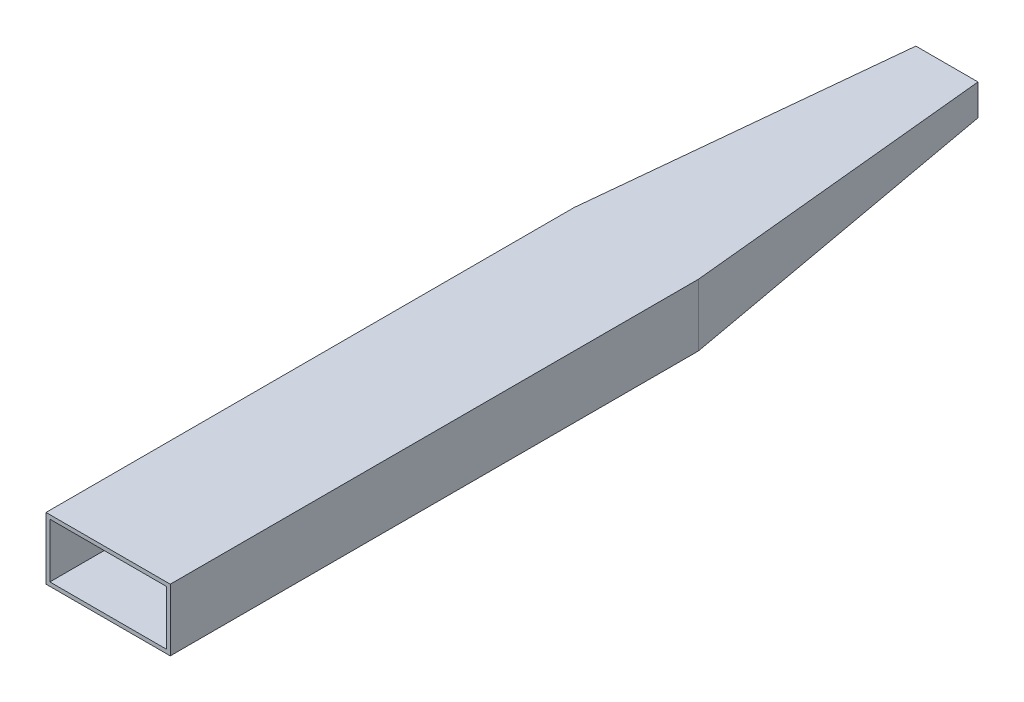
ISO-10303-21;
HEADER;
FILE_DESCRIPTION(('STEP AP214'),'2;1');
FILE_NAME('part.step','',(''),(''),'','','');
FILE_SCHEMA(('AUTOMOTIVE_DESIGN { 1 0 10303 214 1 1 1 1 }'));
ENDSEC;
DATA;
#1=APPLICATION_CONTEXT('core data for automotive mechanical design processes');
#2=APPLICATION_PROTOCOL_DEFINITION('international standard','automotive_design',2000,#1);
#3=PRODUCT_CONTEXT('',#1,'mechanical');
#4=PRODUCT('Part','Part','',(#3));
#5=PRODUCT_RELATED_PRODUCT_CATEGORY('part','',(#4));
#6=PRODUCT_DEFINITION_FORMATION('','',#4);
#7=PRODUCT_DEFINITION_CONTEXT('part definition',#1,'design');
#8=PRODUCT_DEFINITION('design','',#6,#7);
#9=PRODUCT_DEFINITION_SHAPE('','',#8);
#10=(LENGTH_UNIT() NAMED_UNIT(*) SI_UNIT(.MILLI.,.METRE.));
#11=(NAMED_UNIT(*) PLANE_ANGLE_UNIT() SI_UNIT($,.RADIAN.));
#12=(NAMED_UNIT(*) SI_UNIT($,.STERADIAN.) SOLID_ANGLE_UNIT());
#13=UNCERTAINTY_MEASURE_WITH_UNIT(LENGTH_MEASURE(1.E-05),#10,'distance_accuracy_value','');
#14=(GEOMETRIC_REPRESENTATION_CONTEXT(3) GLOBAL_UNCERTAINTY_ASSIGNED_CONTEXT((#13)) GLOBAL_UNIT_ASSIGNED_CONTEXT((#10,
#11,#12)) REPRESENTATION_CONTEXT('',''));
#15=CARTESIAN_POINT('',(0.,0.,0.));
#16=DIRECTION('',(0.,0.,1.));
#17=DIRECTION('',(1.,0.,0.));
#18=AXIS2_PLACEMENT_3D('',#15,#16,#17);
#19=CARTESIAN_POINT('',(0.,0.,0.));
#20=DIRECTION('',(0.,0.,-1.));
#21=DIRECTION('',(-1.,0.,0.));
#22=AXIS2_PLACEMENT_3D('',#19,#20,#21);
#23=PLANE('',#22);
#24=DIRECTION('',(0.,1.,0.));
#25=VECTOR('',#24,1.);
#26=CARTESIAN_POINT('',(50.8,-25.4,0.));
#27=LINE('',#26,#25);
#28=CARTESIAN_POINT('',(50.8,-25.4,0.));
#29=VERTEX_POINT('',#28);
#30=CARTESIAN_POINT('',(50.8,25.4,0.));
#31=VERTEX_POINT('',#30);
#32=EDGE_CURVE('E296',#29,#31,#27,.T.);
#33=ORIENTED_EDGE('',*,*,#32,.T.);
#34=DIRECTION('',(-1.,0.,0.));
#35=VECTOR('',#34,1.);
#36=CARTESIAN_POINT('',(-50.8,25.4,0.));
#37=LINE('',#36,#35);
#38=CARTESIAN_POINT('',(-50.8,25.4,0.));
#39=VERTEX_POINT('',#38);
#40=EDGE_CURVE('E333',#31,#39,#37,.T.);
#41=ORIENTED_EDGE('',*,*,#40,.T.);
#42=DIRECTION('',(0.,-1.,0.));
#43=VECTOR('',#42,1.);
#44=CARTESIAN_POINT('',(-50.8,-25.4,0.));
#45=LINE('',#44,#43);
#46=CARTESIAN_POINT('',(-50.8,-25.4,0.));
#47=VERTEX_POINT('',#46);
#48=EDGE_CURVE('E337',#39,#47,#45,.T.);
#49=ORIENTED_EDGE('',*,*,#48,.T.);
#50=DIRECTION('',(1.,0.,0.));
#51=VECTOR('',#50,1.);
#52=CARTESIAN_POINT('',(-50.8,-25.4,0.));
#53=LINE('',#52,#51);
#54=EDGE_CURVE('E341',#47,#29,#53,.T.);
#55=ORIENTED_EDGE('',*,*,#54,.T.);
#56=EDGE_LOOP('',(#33,#41,#49,#55));
#57=FACE_BOUND('',#56,.T.);
#58=DIRECTION('',(0.,1.,0.));
#59=VECTOR('',#58,1.);
#60=CARTESIAN_POINT('',(47.625,-25.4,0.));
#61=LINE('',#60,#59);
#62=CARTESIAN_POINT('',(47.625,-22.225,0.));
#63=VERTEX_POINT('',#62);
#64=CARTESIAN_POINT('',(47.625,22.225,0.));
#65=VERTEX_POINT('',#64);
#66=EDGE_CURVE('E200',#63,#65,#61,.T.);
#67=ORIENTED_EDGE('',*,*,#66,.F.);
#68=DIRECTION('',(1.,0.,0.));
#69=VECTOR('',#68,1.);
#70=CARTESIAN_POINT('',(-50.8,-22.225,0.));
#71=LINE('',#70,#69);
#72=CARTESIAN_POINT('',(-47.625,-22.225,0.));
#73=VERTEX_POINT('',#72);
#74=EDGE_CURVE('E156',#73,#63,#71,.T.);
#75=ORIENTED_EDGE('',*,*,#74,.F.);
#76=DIRECTION('',(0.,-1.,0.));
#77=VECTOR('',#76,1.);
#78=CARTESIAN_POINT('',(-47.625,-25.4,0.));
#79=LINE('',#78,#77);
#80=CARTESIAN_POINT('',(-47.625,22.225,0.));
#81=VERTEX_POINT('',#80);
#82=EDGE_CURVE('E69',#81,#73,#79,.T.);
#83=ORIENTED_EDGE('',*,*,#82,.F.);
#84=DIRECTION('',(-1.,0.,0.));
#85=VECTOR('',#84,1.);
#86=CARTESIAN_POINT('',(-50.8,22.225,0.));
#87=LINE('',#86,#85);
#88=EDGE_CURVE('E203',#65,#81,#87,.T.);
#89=ORIENTED_EDGE('',*,*,#88,.F.);
#90=EDGE_LOOP('',(#67,#75,#83,#89));
#91=FACE_BOUND('',#90,.T.);
#92=ADVANCED_FACE('F51',(#57,#91),#23,.F.);
#93=CARTESIAN_POINT('',(0.,0.,-685.8));
#94=DIRECTION('',(0.,0.,1.));
#95=DIRECTION('',(1.,0.,0.));
#96=AXIS2_PLACEMENT_3D('',#93,#94,#95);
#97=PLANE('',#96);
#98=DIRECTION('',(0.,-1.,0.));
#99=VECTOR('',#98,1.);
#100=CARTESIAN_POINT('',(25.4,0.,-685.8));
#101=LINE('',#100,#99);
#102=CARTESIAN_POINT('',(25.4,25.4,-685.8));
#103=VERTEX_POINT('',#102);
#104=CARTESIAN_POINT('',(25.4,0.,-685.8));
#105=VERTEX_POINT('',#104);
#106=EDGE_CURVE('E242',#103,#105,#101,.T.);
#107=ORIENTED_EDGE('',*,*,#106,.T.);
#108=DIRECTION('',(-1.,0.,0.));
#109=VECTOR('',#108,1.);
#110=CARTESIAN_POINT('',(25.4,0.,-685.8));
#111=LINE('',#110,#109);
#112=CARTESIAN_POINT('',(-25.4,0.,-685.8));
#113=VERTEX_POINT('',#112);
#114=EDGE_CURVE('E249',#105,#113,#111,.T.);
#115=ORIENTED_EDGE('',*,*,#114,.T.);
#116=DIRECTION('',(0.,1.,0.));
#117=VECTOR('',#116,1.);
#118=CARTESIAN_POINT('',(-25.4,0.,-685.8));
#119=LINE('',#118,#117);
#120=CARTESIAN_POINT('',(-25.4,25.4,-685.8));
#121=VERTEX_POINT('',#120);
#122=EDGE_CURVE('E297',#113,#121,#119,.T.);
#123=ORIENTED_EDGE('',*,*,#122,.T.);
#124=DIRECTION('',(1.,0.,0.));
#125=VECTOR('',#124,1.);
#126=CARTESIAN_POINT('',(25.4,25.4,-685.8));
#127=LINE('',#126,#125);
#128=EDGE_CURVE('E315',#121,#103,#127,.T.);
#129=ORIENTED_EDGE('',*,*,#128,.T.);
#130=EDGE_LOOP('',(#107,#115,#123,#129));
#131=FACE_BOUND('',#130,.T.);
#132=DIRECTION('',(0.,-1.,0.));
#133=VECTOR('',#132,1.);
#134=CARTESIAN_POINT('',(22.2091644902941,0.,-685.8));
#135=LINE('',#134,#133);
#136=CARTESIAN_POINT('',(22.2091644902941,22.225,-685.8));
#137=VERTEX_POINT('',#136);
#138=CARTESIAN_POINT('',(22.2091644902941,3.19083550970587,-685.8));
#139=VERTEX_POINT('',#138);
#140=EDGE_CURVE('E162',#137,#139,#135,.T.);
#141=ORIENTED_EDGE('',*,*,#140,.F.);
#142=DIRECTION('',(1.,0.,0.));
#143=VECTOR('',#142,1.);
#144=CARTESIAN_POINT('',(-50.8,22.225,-685.8));
#145=LINE('',#144,#143);
#146=CARTESIAN_POINT('',(-22.2091644902941,22.225,-685.8));
#147=VERTEX_POINT('',#146);
#148=EDGE_CURVE('E212',#147,#137,#145,.T.);
#149=ORIENTED_EDGE('',*,*,#148,.F.);
#150=DIRECTION('',(0.,1.,0.));
#151=VECTOR('',#150,1.);
#152=CARTESIAN_POINT('',(-22.2091644902941,0.,-685.8));
#153=LINE('',#152,#151);
#154=CARTESIAN_POINT('',(-22.2091644902941,3.19083550970586,-685.8));
#155=VERTEX_POINT('',#154);
#156=EDGE_CURVE('E215',#155,#147,#153,.T.);
#157=ORIENTED_EDGE('',*,*,#156,.F.);
#158=DIRECTION('',(-1.,0.,0.));
#159=VECTOR('',#158,1.);
#160=CARTESIAN_POINT('',(0.,3.19083550970587,-685.8));
#161=LINE('',#160,#159);
#162=EDGE_CURVE('E204',#139,#155,#161,.T.);
#163=ORIENTED_EDGE('',*,*,#162,.F.);
#164=EDGE_LOOP('',(#141,#149,#157,#163));
#165=FACE_BOUND('',#164,.T.);
#166=ADVANCED_FACE('F275',(#131,#165),#97,.F.);
#167=CARTESIAN_POINT('',(50.8,-25.4,-431.8));
#168=DIRECTION('',(1.,0.,0.));
#169=DIRECTION('',(0.,0.,-1.));
#170=AXIS2_PLACEMENT_3D('',#167,#168,#169);
#171=PLANE('',#170);
#172=ORIENTED_EDGE('',*,*,#32,.F.);
#173=DIRECTION('',(0.,0.,1.));
#174=VECTOR('',#173,1.);
#175=CARTESIAN_POINT('',(50.8,-25.4,-431.8));
#176=LINE('',#175,#174);
#177=CARTESIAN_POINT('',(50.8,-25.4,-431.8));
#178=VERTEX_POINT('',#177);
#179=EDGE_CURVE('E12',#178,#29,#176,.T.);
#180=ORIENTED_EDGE('',*,*,#179,.F.);
#181=DIRECTION('',(0.,1.,0.));
#182=VECTOR('',#181,1.);
#183=CARTESIAN_POINT('',(50.8,-25.4,-431.8));
#184=LINE('',#183,#182);
#185=CARTESIAN_POINT('',(50.8,25.4,-431.8));
#186=VERTEX_POINT('',#185);
#187=EDGE_CURVE('E345',#178,#186,#184,.T.);
#188=ORIENTED_EDGE('',*,*,#187,.T.);
#189=DIRECTION('',(0.,0.,1.));
#190=VECTOR('',#189,1.);
#191=CARTESIAN_POINT('',(50.8,25.4,-431.8));
#192=LINE('',#191,#190);
#193=EDGE_CURVE('E349',#186,#31,#192,.T.);
#194=ORIENTED_EDGE('',*,*,#193,.T.);
#195=EDGE_LOOP('',(#172,#180,#188,#194));
#196=FACE_BOUND('',#195,.T.);
#197=ADVANCED_FACE('F53',(#196),#171,.T.);
#198=CARTESIAN_POINT('',(-50.8,-25.4,-431.8));
#199=DIRECTION('',(0.,-1.,0.));
#200=DIRECTION('',(0.,0.,-1.));
#201=AXIS2_PLACEMENT_3D('',#198,#199,#200);
#202=PLANE('',#201);
#203=ORIENTED_EDGE('',*,*,#54,.F.);
#204=DIRECTION('',(0.,0.,1.));
#205=VECTOR('',#204,1.);
#206=CARTESIAN_POINT('',(-50.8,-25.4,-431.8));
#207=LINE('',#206,#205);
#208=CARTESIAN_POINT('',(-50.8,-25.4,-431.8));
#209=VERTEX_POINT('',#208);
#210=EDGE_CURVE('E61',#209,#47,#207,.T.);
#211=ORIENTED_EDGE('',*,*,#210,.F.);
#212=DIRECTION('',(1.,0.,0.));
#213=VECTOR('',#212,1.);
#214=CARTESIAN_POINT('',(-50.8,-25.4,-431.8));
#215=LINE('',#214,#213);
#216=EDGE_CURVE('E351',#209,#178,#215,.T.);
#217=ORIENTED_EDGE('',*,*,#216,.T.);
#218=ORIENTED_EDGE('',*,*,#179,.T.);
#219=EDGE_LOOP('',(#203,#211,#217,#218));
#220=FACE_BOUND('',#219,.T.);
#221=ADVANCED_FACE('F373',(#220),#202,.T.);
#222=CARTESIAN_POINT('',(-50.8,-25.4,-431.8));
#223=DIRECTION('',(-1.,0.,0.));
#224=DIRECTION('',(0.,0.,1.));
#225=AXIS2_PLACEMENT_3D('',#222,#223,#224);
#226=PLANE('',#225);
#227=ORIENTED_EDGE('',*,*,#48,.F.);
#228=DIRECTION('',(0.,0.,1.));
#229=VECTOR('',#228,1.);
#230=CARTESIAN_POINT('',(-50.8,25.4,-431.8));
#231=LINE('',#230,#229);
#232=CARTESIAN_POINT('',(-50.8,25.4,-431.8));
#233=VERTEX_POINT('',#232);
#234=EDGE_CURVE('E346',#233,#39,#231,.T.);
#235=ORIENTED_EDGE('',*,*,#234,.F.);
#236=DIRECTION('',(0.,1.,0.));
#237=VECTOR('',#236,1.);
#238=CARTESIAN_POINT('',(-50.8,-25.4,-431.8));
#239=LINE('',#238,#237);
#240=EDGE_CURVE('E55',#233,#209,#239,.F.);
#241=ORIENTED_EDGE('',*,*,#240,.T.);
#242=ORIENTED_EDGE('',*,*,#210,.T.);
#243=EDGE_LOOP('',(#227,#235,#241,#242));
#244=FACE_BOUND('',#243,.T.);
#245=ADVANCED_FACE('F370',(#244),#226,.T.);
#246=CARTESIAN_POINT('',(-50.8,25.4,-431.8));
#247=DIRECTION('',(0.,1.,0.));
#248=DIRECTION('',(0.,0.,1.));
#249=AXIS2_PLACEMENT_3D('',#246,#247,#248);
#250=PLANE('',#249);
#251=ORIENTED_EDGE('',*,*,#40,.F.);
#252=ORIENTED_EDGE('',*,*,#193,.F.);
#253=DIRECTION('',(-0.0995037190209989,0.,-0.995037190209989));
#254=VECTOR('',#253,1.);
#255=CARTESIAN_POINT('',(50.8,25.4,-431.8));
#256=LINE('',#255,#254);
#257=EDGE_CURVE('E231',#186,#103,#256,.T.);
#258=ORIENTED_EDGE('',*,*,#257,.T.);
#259=ORIENTED_EDGE('',*,*,#128,.F.);
#260=DIRECTION('',(0.099503719020999,0.,-0.995037190209989));
#261=VECTOR('',#260,1.);
#262=CARTESIAN_POINT('',(-50.8,25.4,-431.8));
#263=LINE('',#262,#261);
#264=EDGE_CURVE('E176',#233,#121,#263,.T.);
#265=ORIENTED_EDGE('',*,*,#264,.F.);
#266=ORIENTED_EDGE('',*,*,#234,.T.);
#267=EDGE_LOOP('',(#251,#252,#258,#259,#265,#266));
#268=FACE_BOUND('',#267,.T.);
#269=ADVANCED_FACE('F361',(#268),#250,.T.);
#270=CARTESIAN_POINT('',(-93.0495049504951,0.,-9.30495049504951));
#271=DIRECTION('',(0.995037190209989,0.,0.099503719020999));
#272=DIRECTION('',(0.099503719020999,0.,-0.995037190209989));
#273=AXIS2_PLACEMENT_3D('',#270,#271,#272);
#274=PLANE('',#273);
#275=ORIENTED_EDGE('',*,*,#264,.T.);
#276=ORIENTED_EDGE('',*,*,#122,.F.);
#277=DIRECTION('',(0.0990147542976674,0.0990147542976675,-0.990147542976674));
#278=VECTOR('',#277,1.);
#279=CARTESIAN_POINT('',(-50.8,-25.4,-431.8));
#280=LINE('',#279,#278);
#281=EDGE_CURVE('E225',#209,#113,#280,.T.);
#282=ORIENTED_EDGE('',*,*,#281,.F.);
#283=ORIENTED_EDGE('',*,*,#240,.F.);
#284=EDGE_LOOP('',(#275,#276,#282,#283));
#285=FACE_BOUND('',#284,.T.);
#286=ADVANCED_FACE('F268',(#285),#274,.F.);
#287=CARTESIAN_POINT('',(0.,-67.9009900990099,-6.790099009901));
#288=DIRECTION('',(0.,0.995037190209989,0.099503719020999));
#289=DIRECTION('',(0.,-0.099503719020999,0.995037190209989));
#290=AXIS2_PLACEMENT_3D('',#287,#288,#289);
#291=PLANE('',#290);
#292=ORIENTED_EDGE('',*,*,#281,.T.);
#293=ORIENTED_EDGE('',*,*,#114,.F.);
#294=DIRECTION('',(-0.0990147542976674,0.0990147542976674,-0.990147542976674));
#295=VECTOR('',#294,1.);
#296=CARTESIAN_POINT('',(50.8,-25.4,-431.8));
#297=LINE('',#296,#295);
#298=EDGE_CURVE('E237',#178,#105,#297,.T.);
#299=ORIENTED_EDGE('',*,*,#298,.F.);
#300=ORIENTED_EDGE('',*,*,#216,.F.);
#301=EDGE_LOOP('',(#292,#293,#299,#300));
#302=FACE_BOUND('',#301,.T.);
#303=ADVANCED_FACE('F257',(#302),#291,.F.);
#304=CARTESIAN_POINT('',(93.0495049504951,0.,-9.30495049504951));
#305=DIRECTION('',(-0.995037190209989,0.,0.0995037190209989));
#306=DIRECTION('',(0.0995037190209989,0.,0.995037190209989));
#307=AXIS2_PLACEMENT_3D('',#304,#305,#306);
#308=PLANE('',#307);
#309=ORIENTED_EDGE('',*,*,#298,.T.);
#310=ORIENTED_EDGE('',*,*,#106,.F.);
#311=ORIENTED_EDGE('',*,*,#257,.F.);
#312=ORIENTED_EDGE('',*,*,#187,.F.);
#313=EDGE_LOOP('',(#309,#310,#311,#312));
#314=FACE_BOUND('',#313,.T.);
#315=ADVANCED_FACE('F267',(#314),#308,.F.);
#316=CARTESIAN_POINT('',(47.625,-25.4,-431.8));
#317=DIRECTION('',(1.,0.,0.));
#318=DIRECTION('',(0.,0.,-1.));
#319=AXIS2_PLACEMENT_3D('',#316,#317,#318);
#320=PLANE('',#319);
#321=ORIENTED_EDGE('',*,*,#66,.T.);
#322=DIRECTION('',(0.,0.,1.));
#323=VECTOR('',#322,1.);
#324=CARTESIAN_POINT('',(47.625,22.225,-431.8));
#325=LINE('',#324,#323);
#326=CARTESIAN_POINT('',(47.625,22.225,-431.641644902941));
#327=VERTEX_POINT('',#326);
#328=EDGE_CURVE('E151',#327,#65,#325,.T.);
#329=ORIENTED_EDGE('',*,*,#328,.F.);
#330=DIRECTION('',(0.,1.,0.));
#331=VECTOR('',#330,1.);
#332=CARTESIAN_POINT('',(47.625,0.,-431.641644902941));
#333=LINE('',#332,#331);
#334=CARTESIAN_POINT('',(47.625,-22.225,-431.641644902942));
#335=VERTEX_POINT('',#334);
#336=EDGE_CURVE('E144',#335,#327,#333,.T.);
#337=ORIENTED_EDGE('',*,*,#336,.F.);
#338=DIRECTION('',(0.,0.,1.));
#339=VECTOR('',#338,1.);
#340=CARTESIAN_POINT('',(47.625,-22.225,-431.8));
#341=LINE('',#340,#339);
#342=EDGE_CURVE('E149',#335,#63,#341,.T.);
#343=ORIENTED_EDGE('',*,*,#342,.T.);
#344=EDGE_LOOP('',(#321,#329,#337,#343));
#345=FACE_BOUND('',#344,.T.);
#346=ADVANCED_FACE('F147',(#345),#320,.F.);
#347=CARTESIAN_POINT('',(-50.8,-22.225,-431.8));
#348=DIRECTION('',(0.,-1.,0.));
#349=DIRECTION('',(0.,0.,-1.));
#350=AXIS2_PLACEMENT_3D('',#347,#348,#349);
#351=PLANE('',#350);
#352=ORIENTED_EDGE('',*,*,#74,.T.);
#353=ORIENTED_EDGE('',*,*,#342,.F.);
#354=DIRECTION('',(1.,0.,0.));
#355=VECTOR('',#354,1.);
#356=CARTESIAN_POINT('',(-8.10685811106904E-13,-22.225,-431.641644902942));
#357=LINE('',#356,#355);
#358=CARTESIAN_POINT('',(-47.625,-22.225,-431.641644902941));
#359=VERTEX_POINT('',#358);
#360=EDGE_CURVE('E171',#359,#335,#357,.T.);
#361=ORIENTED_EDGE('',*,*,#360,.F.);
#362=DIRECTION('',(0.,0.,1.));
#363=VECTOR('',#362,1.);
#364=CARTESIAN_POINT('',(-47.625,-22.225,-431.8));
#365=LINE('',#364,#363);
#366=EDGE_CURVE('E177',#359,#73,#365,.T.);
#367=ORIENTED_EDGE('',*,*,#366,.T.);
#368=EDGE_LOOP('',(#352,#353,#361,#367));
#369=FACE_BOUND('',#368,.T.);
#370=ADVANCED_FACE('F170',(#369),#351,.F.);
#371=CARTESIAN_POINT('',(-47.625,-25.4,-431.8));
#372=DIRECTION('',(-1.,0.,0.));
#373=DIRECTION('',(0.,0.,1.));
#374=AXIS2_PLACEMENT_3D('',#371,#372,#373);
#375=PLANE('',#374);
#376=ORIENTED_EDGE('',*,*,#82,.T.);
#377=ORIENTED_EDGE('',*,*,#366,.F.);
#378=DIRECTION('',(0.,-1.,0.));
#379=VECTOR('',#378,1.);
#380=CARTESIAN_POINT('',(-47.625,2.35835872322008E-12,-431.641644902941));
#381=LINE('',#380,#379);
#382=CARTESIAN_POINT('',(-47.625,22.225,-431.641644902941));
#383=VERTEX_POINT('',#382);
#384=EDGE_CURVE('E155',#383,#359,#381,.T.);
#385=ORIENTED_EDGE('',*,*,#384,.F.);
#386=DIRECTION('',(0.,0.,1.));
#387=VECTOR('',#386,1.);
#388=CARTESIAN_POINT('',(-47.625,22.225,-431.8));
#389=LINE('',#388,#387);
#390=EDGE_CURVE('E186',#383,#81,#389,.T.);
#391=ORIENTED_EDGE('',*,*,#390,.T.);
#392=EDGE_LOOP('',(#376,#377,#385,#391));
#393=FACE_BOUND('',#392,.T.);
#394=ADVANCED_FACE('F391',(#393),#375,.F.);
#395=CARTESIAN_POINT('',(-50.8,22.225,-431.8));
#396=DIRECTION('',(0.,1.,0.));
#397=DIRECTION('',(0.,0.,1.));
#398=AXIS2_PLACEMENT_3D('',#395,#396,#397);
#399=PLANE('',#398);
#400=ORIENTED_EDGE('',*,*,#88,.T.);
#401=ORIENTED_EDGE('',*,*,#390,.F.);
#402=DIRECTION('',(0.099503719020999,0.,-0.995037190209989));
#403=VECTOR('',#402,1.);
#404=CARTESIAN_POINT('',(-47.6407569210833,22.225,-431.484075692108));
#405=LINE('',#404,#403);
#406=EDGE_CURVE('E77',#383,#147,#405,.T.);
#407=ORIENTED_EDGE('',*,*,#406,.T.);
#408=ORIENTED_EDGE('',*,*,#148,.T.);
#409=DIRECTION('',(-0.0995037190209989,0.,-0.995037190209989));
#410=VECTOR('',#409,1.);
#411=CARTESIAN_POINT('',(89.8902618715783,22.225,-8.98902618715783));
#412=LINE('',#411,#410);
#413=EDGE_CURVE('E167',#327,#137,#412,.T.);
#414=ORIENTED_EDGE('',*,*,#413,.F.);
#415=ORIENTED_EDGE('',*,*,#328,.T.);
#416=EDGE_LOOP('',(#400,#401,#407,#408,#414,#415));
#417=FACE_BOUND('',#416,.T.);
#418=ADVANCED_FACE('F385',(#417),#399,.F.);
#419=CARTESIAN_POINT('',(-89.8902618715784,0.,-8.98902618715784));
#420=DIRECTION('',(0.995037190209989,0.,0.099503719020999));
#421=DIRECTION('',(0.099503719020999,0.,-0.995037190209989));
#422=AXIS2_PLACEMENT_3D('',#419,#420,#421);
#423=PLANE('',#422);
#424=ORIENTED_EDGE('',*,*,#406,.F.);
#425=ORIENTED_EDGE('',*,*,#384,.T.);
#426=DIRECTION('',(0.0990147542976675,0.0990147542976675,-0.990147542976674));
#427=VECTOR('',#426,1.);
#428=CARTESIAN_POINT('',(-89.2580044022492,-63.8580044022492,-15.3116008804499));
#429=LINE('',#428,#427);
#430=EDGE_CURVE('E181',#359,#155,#429,.T.);
#431=ORIENTED_EDGE('',*,*,#430,.T.);
#432=ORIENTED_EDGE('',*,*,#156,.T.);
#433=EDGE_LOOP('',(#424,#425,#431,#432));
#434=FACE_BOUND('',#433,.T.);
#435=ADVANCED_FACE('F390',(#434),#423,.T.);
#436=CARTESIAN_POINT('',(0.,-64.7417470200932,-6.47417470200933));
#437=DIRECTION('',(0.,0.995037190209989,0.099503719020999));
#438=DIRECTION('',(0.,-0.099503719020999,0.995037190209989));
#439=AXIS2_PLACEMENT_3D('',#436,#437,#438);
#440=PLANE('',#439);
#441=ORIENTED_EDGE('',*,*,#430,.F.);
#442=ORIENTED_EDGE('',*,*,#360,.T.);
#443=DIRECTION('',(-0.0990147542976674,0.0990147542976675,-0.990147542976675));
#444=VECTOR('',#443,1.);
#445=CARTESIAN_POINT('',(89.2580044022492,-63.8580044022492,-15.3116008804498));
#446=LINE('',#445,#444);
#447=EDGE_CURVE('E159',#335,#139,#446,.T.);
#448=ORIENTED_EDGE('',*,*,#447,.T.);
#449=ORIENTED_EDGE('',*,*,#162,.T.);
#450=EDGE_LOOP('',(#441,#442,#448,#449));
#451=FACE_BOUND('',#450,.T.);
#452=ADVANCED_FACE('F179',(#451),#440,.T.);
#453=CARTESIAN_POINT('',(89.8902618715783,0.,-8.98902618715783));
#454=DIRECTION('',(-0.995037190209989,0.,0.0995037190209989));
#455=DIRECTION('',(0.0995037190209989,0.,0.995037190209989));
#456=AXIS2_PLACEMENT_3D('',#453,#454,#455);
#457=PLANE('',#456);
#458=ORIENTED_EDGE('',*,*,#447,.F.);
#459=ORIENTED_EDGE('',*,*,#336,.T.);
#460=ORIENTED_EDGE('',*,*,#413,.T.);
#461=ORIENTED_EDGE('',*,*,#140,.T.);
#462=EDGE_LOOP('',(#458,#459,#460,#461));
#463=FACE_BOUND('',#462,.T.);
#464=ADVANCED_FACE('F160',(#463),#457,.T.);
#465=CLOSED_SHELL('',(#92,#166,#197,#221,#245,#269,#286,#303,#315,#346,#370,#394,#418,#435,#452,#464));
#466=MANIFOLD_SOLID_BREP('B2',#465);
#467=ADVANCED_BREP_SHAPE_REPRESENTATION('',(#18,#466),#14);
#468=SHAPE_DEFINITION_REPRESENTATION(#9,#467);
ENDSEC;
END-ISO-10303-21;
